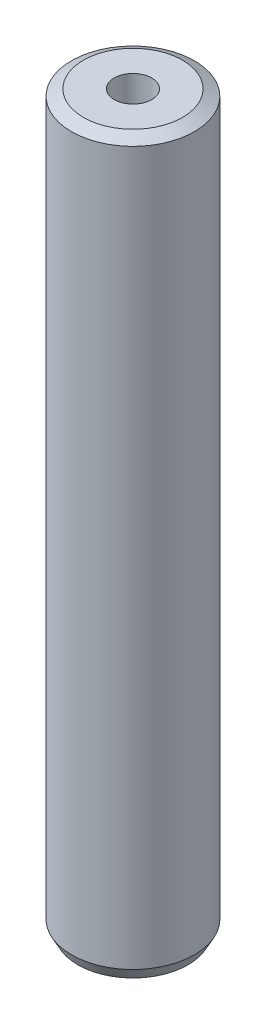
ISO-10303-21;
HEADER;
FILE_DESCRIPTION(('STEP AP214'),'2;1');
FILE_NAME('part.step','',(''),(''),'','','');
FILE_SCHEMA(('AUTOMOTIVE_DESIGN { 1 0 10303 214 1 1 1 1 }'));
ENDSEC;
DATA;
#1=APPLICATION_CONTEXT('core data for automotive mechanical design processes');
#2=APPLICATION_PROTOCOL_DEFINITION('international standard','automotive_design',2000,#1);
#3=PRODUCT_CONTEXT('',#1,'mechanical');
#4=PRODUCT('Part','Part','',(#3));
#5=PRODUCT_RELATED_PRODUCT_CATEGORY('part','',(#4));
#6=PRODUCT_DEFINITION_FORMATION('','',#4);
#7=PRODUCT_DEFINITION_CONTEXT('part definition',#1,'design');
#8=PRODUCT_DEFINITION('design','',#6,#7);
#9=PRODUCT_DEFINITION_SHAPE('','',#8);
#10=(LENGTH_UNIT() NAMED_UNIT(*) SI_UNIT(.MILLI.,.METRE.));
#11=(NAMED_UNIT(*) PLANE_ANGLE_UNIT() SI_UNIT($,.RADIAN.));
#12=(NAMED_UNIT(*) SI_UNIT($,.STERADIAN.) SOLID_ANGLE_UNIT());
#13=UNCERTAINTY_MEASURE_WITH_UNIT(LENGTH_MEASURE(1.E-05),#10,'distance_accuracy_value','');
#14=(GEOMETRIC_REPRESENTATION_CONTEXT(3) GLOBAL_UNCERTAINTY_ASSIGNED_CONTEXT((#13)) GLOBAL_UNIT_ASSIGNED_CONTEXT((#10,
#11,#12)) REPRESENTATION_CONTEXT('',''));
#15=CARTESIAN_POINT('',(0.,0.,0.));
#16=DIRECTION('',(0.,0.,1.));
#17=DIRECTION('',(1.,0.,0.));
#18=AXIS2_PLACEMENT_3D('',#15,#16,#17);
#19=CARTESIAN_POINT('',(0.,267.63038702852,0.));
#20=DIRECTION('',(0.,-1.,0.));
#21=DIRECTION('',(0.,0.,-1.));
#22=AXIS2_PLACEMENT_3D('',#19,#20,#21);
#23=CYLINDRICAL_SURFACE('',#22,22.5);
#24=CARTESIAN_POINT('',(0.,265.288722395219,0.));
#25=DIRECTION('',(0.,1.,0.));
#26=DIRECTION('',(0.,0.,1.));
#27=AXIS2_PLACEMENT_3D('',#24,#25,#26);
#28=CIRCLE('',#27,22.5);
#29=CARTESIAN_POINT('',(0.,265.288722395219,22.5));
#30=VERTEX_POINT('',#29);
#31=EDGE_CURVE('E50',#30,#30,#28,.F.);
#32=ORIENTED_EDGE('',*,*,#31,.T.);
#33=EDGE_LOOP('',(#32));
#34=FACE_BOUND('',#33,.T.);
#35=CARTESIAN_POINT('',(0.,4.35188522978364,0.));
#36=DIRECTION('',(0.,1.,0.));
#37=DIRECTION('',(0.,0.,1.));
#38=AXIS2_PLACEMENT_3D('',#35,#36,#37);
#39=CIRCLE('',#38,22.5);
#40=CARTESIAN_POINT('',(0.,4.35188522978364,22.5));
#41=VERTEX_POINT('',#40);
#42=EDGE_CURVE('E51',#41,#41,#39,.T.);
#43=ORIENTED_EDGE('',*,*,#42,.T.);
#44=EDGE_LOOP('',(#43));
#45=FACE_BOUND('',#44,.T.);
#46=ADVANCED_FACE('F39',(#34,#45),#23,.T.);
#47=CARTESIAN_POINT('',(0.,267.63038702852,0.));
#48=DIRECTION('',(0.,1.,0.));
#49=DIRECTION('',(0.,0.,1.));
#50=AXIS2_PLACEMENT_3D('',#47,#48,#49);
#51=PLANE('',#50);
#52=CARTESIAN_POINT('',(0.,267.63038702852,0.));
#53=DIRECTION('',(0.,1.,0.));
#54=DIRECTION('',(0.,0.,1.));
#55=AXIS2_PLACEMENT_3D('',#52,#53,#54);
#56=CIRCLE('',#55,18.1481147702164);
#57=CARTESIAN_POINT('',(0.,267.63038702852,18.1481147702164));
#58=VERTEX_POINT('',#57);
#59=EDGE_CURVE('E54',#58,#58,#56,.T.);
#60=ORIENTED_EDGE('',*,*,#59,.T.);
#61=EDGE_LOOP('',(#60));
#62=FACE_BOUND('',#61,.T.);
#63=CARTESIAN_POINT('',(0.,267.63038702852,0.));
#64=DIRECTION('',(0.,1.,0.));
#65=DIRECTION('',(0.,0.,1.));
#66=AXIS2_PLACEMENT_3D('',#63,#64,#65);
#67=CIRCLE('',#66,6.87487538709584);
#68=CARTESIAN_POINT('',(0.,267.63038702852,6.87487538709584));
#69=VERTEX_POINT('',#68);
#70=EDGE_CURVE('E58',#69,#69,#67,.T.);
#71=ORIENTED_EDGE('',*,*,#70,.F.);
#72=EDGE_LOOP('',(#71));
#73=FACE_BOUND('',#72,.T.);
#74=ADVANCED_FACE('F69',(#62,#73),#51,.T.);
#75=CARTESIAN_POINT('',(0.,0.,0.));
#76=DIRECTION('',(0.,1.,0.));
#77=DIRECTION('',(0.,0.,1.));
#78=AXIS2_PLACEMENT_3D('',#75,#76,#77);
#79=PLANE('',#78);
#80=CARTESIAN_POINT('',(0.,0.,0.));
#81=DIRECTION('',(0.,1.,0.));
#82=DIRECTION('',(0.,0.,1.));
#83=AXIS2_PLACEMENT_3D('',#80,#81,#82);
#84=CIRCLE('',#83,20.1583353666993);
#85=CARTESIAN_POINT('',(0.,0.,20.1583353666993));
#86=VERTEX_POINT('',#85);
#87=EDGE_CURVE('E10',#86,#86,#84,.F.);
#88=ORIENTED_EDGE('',*,*,#87,.T.);
#89=EDGE_LOOP('',(#88));
#90=FACE_BOUND('',#89,.T.);
#91=CARTESIAN_POINT('',(0.,0.,0.));
#92=DIRECTION('',(0.,1.,0.));
#93=DIRECTION('',(0.,0.,1.));
#94=AXIS2_PLACEMENT_3D('',#91,#92,#93);
#95=CIRCLE('',#94,6.87487538709584);
#96=CARTESIAN_POINT('',(0.,0.,6.87487538709584));
#97=VERTEX_POINT('',#96);
#98=EDGE_CURVE('E63',#97,#97,#95,.T.);
#99=ORIENTED_EDGE('',*,*,#98,.T.);
#100=EDGE_LOOP('',(#99));
#101=FACE_BOUND('',#100,.T.);
#102=ADVANCED_FACE('F75',(#90,#101),#79,.F.);
#103=CARTESIAN_POINT('',(0.,267.63038702852,0.));
#104=DIRECTION('',(0.,-1.,0.));
#105=DIRECTION('',(0.,0.,-1.));
#106=AXIS2_PLACEMENT_3D('',#103,#104,#105);
#107=CYLINDRICAL_SURFACE('',#106,6.87487538709584);
#108=ORIENTED_EDGE('',*,*,#70,.T.);
#109=EDGE_LOOP('',(#108));
#110=FACE_BOUND('',#109,.T.);
#111=ORIENTED_EDGE('',*,*,#98,.F.);
#112=EDGE_LOOP('',(#111));
#113=FACE_BOUND('',#112,.T.);
#114=ADVANCED_FACE('F70',(#110,#113),#107,.F.);
#115=CARTESIAN_POINT('',(0.,267.63038702852,0.));
#116=DIRECTION('',(0.,-1.,0.));
#117=DIRECTION('',(0.,0.,-1.));
#118=AXIS2_PLACEMENT_3D('',#115,#116,#117);
#119=CONICAL_SURFACE('',#118,18.1481147702164,1.07715038763104);
#120=ORIENTED_EDGE('',*,*,#31,.F.);
#121=EDGE_LOOP('',(#120));
#122=FACE_BOUND('',#121,.T.);
#123=ORIENTED_EDGE('',*,*,#59,.F.);
#124=EDGE_LOOP('',(#123));
#125=FACE_BOUND('',#124,.T.);
#126=ADVANCED_FACE('F81',(#122,#125),#119,.T.);
#127=CARTESIAN_POINT('',(0.,4.35188522978364,0.));
#128=DIRECTION('',(0.,1.,0.));
#129=DIRECTION('',(0.,0.,1.));
#130=AXIS2_PLACEMENT_3D('',#127,#128,#129);
#131=CONICAL_SURFACE('',#130,22.5,0.493645939163852);
#132=ORIENTED_EDGE('',*,*,#87,.F.);
#133=EDGE_LOOP('',(#132));
#134=FACE_BOUND('',#133,.T.);
#135=ORIENTED_EDGE('',*,*,#42,.F.);
#136=EDGE_LOOP('',(#135));
#137=FACE_BOUND('',#136,.T.);
#138=ADVANCED_FACE('F45',(#134,#137),#131,.T.);
#139=CLOSED_SHELL('',(#46,#74,#102,#114,#126,#138));
#140=MANIFOLD_SOLID_BREP('B2',#139);
#141=ADVANCED_BREP_SHAPE_REPRESENTATION('',(#18,#140),#14);
#142=SHAPE_DEFINITION_REPRESENTATION(#9,#141);
ENDSEC;
END-ISO-10303-21;
